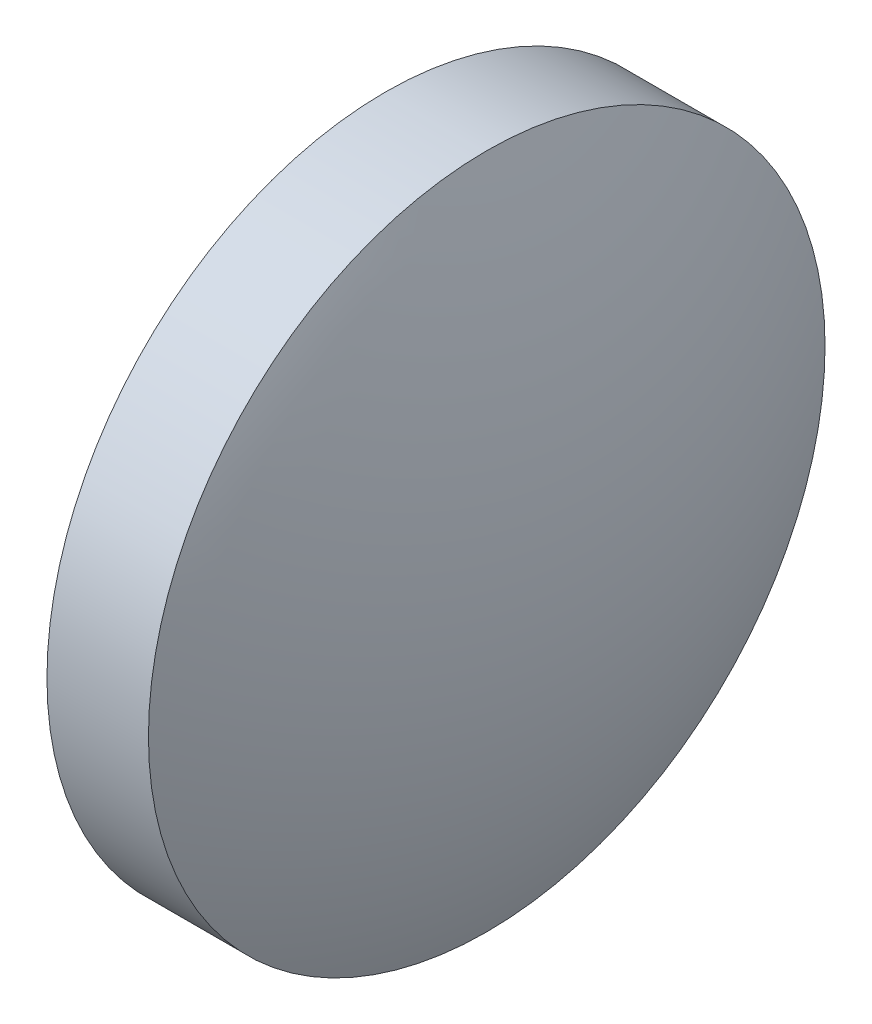
ISO-10303-21;
HEADER;
FILE_DESCRIPTION(('STEP AP214'),'2;1');
FILE_NAME('part.step','',(''),(''),'','','');
FILE_SCHEMA(('AUTOMOTIVE_DESIGN { 1 0 10303 214 1 1 1 1 }'));
ENDSEC;
DATA;
#1=APPLICATION_CONTEXT('core data for automotive mechanical design processes');
#2=APPLICATION_PROTOCOL_DEFINITION('international standard','automotive_design',2000,#1);
#3=PRODUCT_CONTEXT('',#1,'mechanical');
#4=PRODUCT('Part','Part','',(#3));
#5=PRODUCT_RELATED_PRODUCT_CATEGORY('part','',(#4));
#6=PRODUCT_DEFINITION_FORMATION('','',#4);
#7=PRODUCT_DEFINITION_CONTEXT('part definition',#1,'design');
#8=PRODUCT_DEFINITION('design','',#6,#7);
#9=PRODUCT_DEFINITION_SHAPE('','',#8);
#10=(LENGTH_UNIT() NAMED_UNIT(*) SI_UNIT(.MILLI.,.METRE.));
#11=(NAMED_UNIT(*) PLANE_ANGLE_UNIT() SI_UNIT($,.RADIAN.));
#12=(NAMED_UNIT(*) SI_UNIT($,.STERADIAN.) SOLID_ANGLE_UNIT());
#13=UNCERTAINTY_MEASURE_WITH_UNIT(LENGTH_MEASURE(1.E-05),#10,'distance_accuracy_value','');
#14=(GEOMETRIC_REPRESENTATION_CONTEXT(3) GLOBAL_UNCERTAINTY_ASSIGNED_CONTEXT((#13)) GLOBAL_UNIT_ASSIGNED_CONTEXT((#10,
#11,#12)) REPRESENTATION_CONTEXT('',''));
#15=CARTESIAN_POINT('',(0.,0.,0.));
#16=DIRECTION('',(0.,0.,1.));
#17=DIRECTION('',(1.,0.,0.));
#18=AXIS2_PLACEMENT_3D('',#15,#16,#17);
#19=CARTESIAN_POINT('',(311.496681785893,133.981413843423,0.));
#20=DIRECTION('',(-1.,0.,0.));
#21=DIRECTION('',(0.,1.,0.));
#22=AXIS2_PLACEMENT_3D('',#19,#20,#21);
#23=SPHERICAL_SURFACE('',#22,85.9272564964143);
#24=CARTESIAN_POINT('',(233.020612764818,133.981413843423,0.));
#25=DIRECTION('',(-1.,0.,0.));
#26=DIRECTION('',(0.,0.,1.));
#27=AXIS2_PLACEMENT_3D('',#24,#25,#26);
#28=CIRCLE('',#27,35.);
#29=CARTESIAN_POINT('',(233.020612764818,133.981413843423,35.));
#30=VERTEX_POINT('',#29);
#31=EDGE_CURVE('E46',#30,#30,#28,.T.);
#32=ORIENTED_EDGE('',*,*,#31,.T.);
#33=EDGE_LOOP('',(#32));
#34=FACE_BOUND('',#33,.T.);
#35=ADVANCED_FACE('F39',(#34),#23,.T.);
#36=CARTESIAN_POINT('',(165.044543743743,133.981413843423,0.));
#37=DIRECTION('',(-1.,0.,0.));
#38=DIRECTION('',(0.,-1.,0.));
#39=AXIS2_PLACEMENT_3D('',#36,#37,#38);
#40=SPHERICAL_SURFACE('',#39,85.9272564964145);
#41=CARTESIAN_POINT('',(243.520612764818,133.981413843423,0.));
#42=DIRECTION('',(-1.,0.,0.));
#43=DIRECTION('',(0.,0.,1.));
#44=AXIS2_PLACEMENT_3D('',#41,#42,#43);
#45=CIRCLE('',#44,35.);
#46=CARTESIAN_POINT('',(243.520612764818,133.981413843423,35.));
#47=VERTEX_POINT('',#46);
#48=EDGE_CURVE('E10',#47,#47,#45,.T.);
#49=ORIENTED_EDGE('',*,*,#48,.F.);
#50=EDGE_LOOP('',(#49));
#51=FACE_BOUND('',#50,.T.);
#52=ADVANCED_FACE('F56',(#51),#40,.T.);
#53=CARTESIAN_POINT('',(222.89660664848,133.981413843423,0.));
#54=DIRECTION('',(-1.,0.,0.));
#55=DIRECTION('',(0.,0.,1.));
#56=AXIS2_PLACEMENT_3D('',#53,#54,#55);
#57=CYLINDRICAL_SURFACE('',#56,35.);
#58=ORIENTED_EDGE('',*,*,#48,.T.);
#59=EDGE_LOOP('',(#58));
#60=FACE_BOUND('',#59,.T.);
#61=ORIENTED_EDGE('',*,*,#31,.F.);
#62=EDGE_LOOP('',(#61));
#63=FACE_BOUND('',#62,.T.);
#64=ADVANCED_FACE('F54',(#60,#63),#57,.T.);
#65=CLOSED_SHELL('',(#35,#52,#64));
#66=MANIFOLD_SOLID_BREP('B2',#65);
#67=ADVANCED_BREP_SHAPE_REPRESENTATION('',(#18,#66),#14);
#68=SHAPE_DEFINITION_REPRESENTATION(#9,#67);
ENDSEC;
END-ISO-10303-21;
